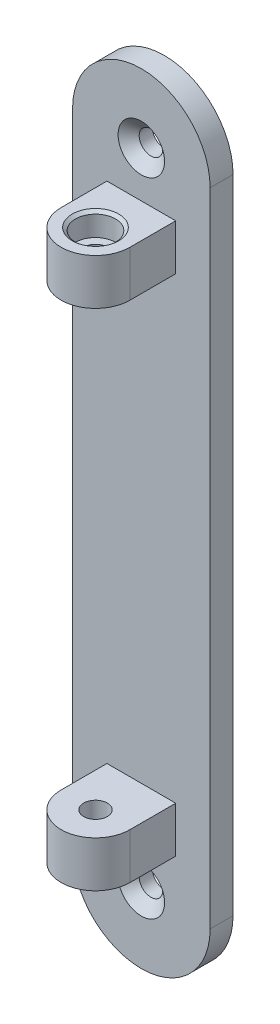
ISO-10303-21;
HEADER;
FILE_DESCRIPTION(('STEP AP214'),'2;1');
FILE_NAME('part.step','',(''),(''),'','','');
FILE_SCHEMA(('AUTOMOTIVE_DESIGN { 1 0 10303 214 1 1 1 1 }'));
ENDSEC;
DATA;
#1=APPLICATION_CONTEXT('core data for automotive mechanical design processes');
#2=APPLICATION_PROTOCOL_DEFINITION('international standard','automotive_design',2000,#1);
#3=PRODUCT_CONTEXT('',#1,'mechanical');
#4=PRODUCT('Part','Part','',(#3));
#5=PRODUCT_RELATED_PRODUCT_CATEGORY('part','',(#4));
#6=PRODUCT_DEFINITION_FORMATION('','',#4);
#7=PRODUCT_DEFINITION_CONTEXT('part definition',#1,'design');
#8=PRODUCT_DEFINITION('design','',#6,#7);
#9=PRODUCT_DEFINITION_SHAPE('','',#8);
#10=(LENGTH_UNIT() NAMED_UNIT(*) SI_UNIT(.MILLI.,.METRE.));
#11=(NAMED_UNIT(*) PLANE_ANGLE_UNIT() SI_UNIT($,.RADIAN.));
#12=(NAMED_UNIT(*) SI_UNIT($,.STERADIAN.) SOLID_ANGLE_UNIT());
#13=UNCERTAINTY_MEASURE_WITH_UNIT(LENGTH_MEASURE(1.E-05),#10,'distance_accuracy_value','');
#14=(GEOMETRIC_REPRESENTATION_CONTEXT(3) GLOBAL_UNCERTAINTY_ASSIGNED_CONTEXT((#13)) GLOBAL_UNIT_ASSIGNED_CONTEXT((#10,
#11,#12)) REPRESENTATION_CONTEXT('',''));
#15=CARTESIAN_POINT('',(0.,0.,0.));
#16=DIRECTION('',(0.,0.,1.));
#17=DIRECTION('',(1.,0.,0.));
#18=AXIS2_PLACEMENT_3D('',#15,#16,#17);
#19=CARTESIAN_POINT('',(19.05,88.9,0.));
#20=DIRECTION('',(0.,0.,-1.));
#21=DIRECTION('',(-1.,0.,0.));
#22=AXIS2_PLACEMENT_3D('',#19,#20,#21);
#23=PLANE('',#22);
#24=DIRECTION('',(0.,-1.,0.));
#25=VECTOR('',#24,1.);
#26=CARTESIAN_POINT('',(0.,0.,0.));
#27=LINE('',#26,#25);
#28=CARTESIAN_POINT('',(0.,88.9,0.));
#29=VERTEX_POINT('',#28);
#30=CARTESIAN_POINT('',(0.,-88.9,0.));
#31=VERTEX_POINT('',#30);
#32=EDGE_CURVE('E292',#29,#31,#27,.T.);
#33=ORIENTED_EDGE('',*,*,#32,.T.);
#34=CARTESIAN_POINT('',(19.05,-88.9,0.));
#35=DIRECTION('',(0.,0.,-1.));
#36=DIRECTION('',(-1.,0.,0.));
#37=AXIS2_PLACEMENT_3D('',#34,#35,#36);
#38=CIRCLE('',#37,19.05);
#39=CARTESIAN_POINT('',(38.1,-88.9,0.));
#40=VERTEX_POINT('',#39);
#41=EDGE_CURVE('E195',#40,#31,#38,.T.);
#42=ORIENTED_EDGE('',*,*,#41,.F.);
#43=DIRECTION('',(0.,1.,0.));
#44=VECTOR('',#43,1.);
#45=CARTESIAN_POINT('',(38.1,88.9,0.));
#46=LINE('',#45,#44);
#47=CARTESIAN_POINT('',(38.1,88.9,0.));
#48=VERTEX_POINT('',#47);
#49=EDGE_CURVE('E286',#40,#48,#46,.T.);
#50=ORIENTED_EDGE('',*,*,#49,.T.);
#51=CARTESIAN_POINT('',(19.05,88.9,0.));
#52=DIRECTION('',(0.,0.,1.));
#53=DIRECTION('',(-1.,0.,0.));
#54=AXIS2_PLACEMENT_3D('',#51,#52,#53);
#55=CIRCLE('',#54,19.05);
#56=EDGE_CURVE('E302',#48,#29,#55,.T.);
#57=ORIENTED_EDGE('',*,*,#56,.T.);
#58=EDGE_LOOP('',(#33,#42,#50,#57));
#59=FACE_BOUND('',#58,.T.);
#60=CARTESIAN_POINT('',(19.05,88.9,0.));
#61=DIRECTION('',(0.,0.,1.));
#62=DIRECTION('',(1.,0.,0.));
#63=AXIS2_PLACEMENT_3D('',#60,#61,#62);
#64=CIRCLE('',#63,6.4389);
#65=CARTESIAN_POINT('',(25.4889,88.9,0.));
#66=VERTEX_POINT('',#65);
#67=EDGE_CURVE('E274',#66,#66,#64,.T.);
#68=ORIENTED_EDGE('',*,*,#67,.F.);
#69=EDGE_LOOP('',(#68));
#70=FACE_BOUND('',#69,.T.);
#71=DIRECTION('',(0.,-1.,0.));
#72=VECTOR('',#71,1.);
#73=CARTESIAN_POINT('',(9.52500000000001,76.2,0.));
#74=LINE('',#73,#72);
#75=CARTESIAN_POINT('',(9.52500000000001,76.2,0.));
#76=VERTEX_POINT('',#75);
#77=CARTESIAN_POINT('',(9.525,63.5,0.));
#78=VERTEX_POINT('',#77);
#79=EDGE_CURVE('E236',#76,#78,#74,.T.);
#80=ORIENTED_EDGE('',*,*,#79,.F.);
#81=DIRECTION('',(-1.,0.,0.));
#82=VECTOR('',#81,1.);
#83=CARTESIAN_POINT('',(9.52500000000001,76.2,0.));
#84=LINE('',#83,#82);
#85=CARTESIAN_POINT('',(28.575,76.2,0.));
#86=VERTEX_POINT('',#85);
#87=EDGE_CURVE('E245',#86,#76,#84,.T.);
#88=ORIENTED_EDGE('',*,*,#87,.F.);
#89=DIRECTION('',(0.,1.,0.));
#90=VECTOR('',#89,1.);
#91=CARTESIAN_POINT('',(28.575,76.2,0.));
#92=LINE('',#91,#90);
#93=CARTESIAN_POINT('',(28.575,63.5,0.));
#94=VERTEX_POINT('',#93);
#95=EDGE_CURVE('E60',#94,#86,#92,.T.);
#96=ORIENTED_EDGE('',*,*,#95,.F.);
#97=DIRECTION('',(1.,0.,0.));
#98=VECTOR('',#97,1.);
#99=CARTESIAN_POINT('',(9.525,63.5,0.));
#100=LINE('',#99,#98);
#101=EDGE_CURVE('E55',#78,#94,#100,.T.);
#102=ORIENTED_EDGE('',*,*,#101,.F.);
#103=EDGE_LOOP('',(#80,#88,#96,#102));
#104=FACE_BOUND('',#103,.T.);
#105=CARTESIAN_POINT('',(19.05,-88.9,0.));
#106=DIRECTION('',(0.,0.,-1.));
#107=DIRECTION('',(1.,0.,0.));
#108=AXIS2_PLACEMENT_3D('',#105,#106,#107);
#109=CIRCLE('',#108,6.4389);
#110=CARTESIAN_POINT('',(25.4889,-88.9,0.));
#111=VERTEX_POINT('',#110);
#112=EDGE_CURVE('E183',#111,#111,#109,.T.);
#113=ORIENTED_EDGE('',*,*,#112,.T.);
#114=EDGE_LOOP('',(#113));
#115=FACE_BOUND('',#114,.T.);
#116=DIRECTION('',(0.,1.,0.));
#117=VECTOR('',#116,1.);
#118=CARTESIAN_POINT('',(9.525,-76.2,0.));
#119=LINE('',#118,#117);
#120=CARTESIAN_POINT('',(9.525,-76.2,0.));
#121=VERTEX_POINT('',#120);
#122=CARTESIAN_POINT('',(9.525,-63.5,0.));
#123=VERTEX_POINT('',#122);
#124=EDGE_CURVE('E154',#121,#123,#119,.T.);
#125=ORIENTED_EDGE('',*,*,#124,.T.);
#126=DIRECTION('',(1.,0.,0.));
#127=VECTOR('',#126,1.);
#128=CARTESIAN_POINT('',(9.525,-63.5,0.));
#129=LINE('',#128,#127);
#130=CARTESIAN_POINT('',(28.575,-63.5,0.));
#131=VERTEX_POINT('',#130);
#132=EDGE_CURVE('E159',#123,#131,#129,.T.);
#133=ORIENTED_EDGE('',*,*,#132,.T.);
#134=DIRECTION('',(0.,-1.,0.));
#135=VECTOR('',#134,1.);
#136=CARTESIAN_POINT('',(28.575,-76.2,0.));
#137=LINE('',#136,#135);
#138=CARTESIAN_POINT('',(28.575,-76.2,0.));
#139=VERTEX_POINT('',#138);
#140=EDGE_CURVE('E143',#131,#139,#137,.T.);
#141=ORIENTED_EDGE('',*,*,#140,.T.);
#142=DIRECTION('',(-1.,0.,0.));
#143=VECTOR('',#142,1.);
#144=CARTESIAN_POINT('',(9.525,-76.2,0.));
#145=LINE('',#144,#143);
#146=EDGE_CURVE('E168',#139,#121,#145,.T.);
#147=ORIENTED_EDGE('',*,*,#146,.T.);
#148=EDGE_LOOP('',(#125,#133,#141,#147));
#149=FACE_BOUND('',#148,.T.);
#150=ADVANCED_FACE('F39',(#59,#70,#104,#115,#149),#23,.F.);
#151=CARTESIAN_POINT('',(0.,0.,-6.35));
#152=DIRECTION('',(-1.,0.,0.));
#153=DIRECTION('',(0.,0.,1.));
#154=AXIS2_PLACEMENT_3D('',#151,#152,#153);
#155=PLANE('',#154);
#156=ORIENTED_EDGE('',*,*,#32,.F.);
#157=DIRECTION('',(0.,0.,1.));
#158=VECTOR('',#157,1.);
#159=CARTESIAN_POINT('',(0.,88.9,-6.35));
#160=LINE('',#159,#158);
#161=CARTESIAN_POINT('',(0.,88.9,-6.35));
#162=VERTEX_POINT('',#161);
#163=EDGE_CURVE('E11',#162,#29,#160,.T.);
#164=ORIENTED_EDGE('',*,*,#163,.F.);
#165=DIRECTION('',(0.,-1.,0.));
#166=VECTOR('',#165,1.);
#167=CARTESIAN_POINT('',(0.,0.,-6.35));
#168=LINE('',#167,#166);
#169=CARTESIAN_POINT('',(0.,-88.9,-6.35));
#170=VERTEX_POINT('',#169);
#171=EDGE_CURVE('E296',#162,#170,#168,.T.);
#172=ORIENTED_EDGE('',*,*,#171,.T.);
#173=DIRECTION('',(0.,0.,1.));
#174=VECTOR('',#173,1.);
#175=CARTESIAN_POINT('',(0.,-88.9,-6.35));
#176=LINE('',#175,#174);
#177=EDGE_CURVE('E204',#170,#31,#176,.T.);
#178=ORIENTED_EDGE('',*,*,#177,.T.);
#179=EDGE_LOOP('',(#156,#164,#172,#178));
#180=FACE_BOUND('',#179,.T.);
#181=ADVANCED_FACE('F314',(#180),#155,.T.);
#182=CARTESIAN_POINT('',(19.05,88.9,-6.35));
#183=DIRECTION('',(0.,0.,1.));
#184=DIRECTION('',(1.,0.,0.));
#185=AXIS2_PLACEMENT_3D('',#182,#183,#184);
#186=CYLINDRICAL_SURFACE('',#185,19.05);
#187=ORIENTED_EDGE('',*,*,#56,.F.);
#188=DIRECTION('',(0.,0.,1.));
#189=VECTOR('',#188,1.);
#190=CARTESIAN_POINT('',(38.1,88.9,-6.35));
#191=LINE('',#190,#189);
#192=CARTESIAN_POINT('',(38.1,88.9,-6.35));
#193=VERTEX_POINT('',#192);
#194=EDGE_CURVE('E43',#193,#48,#191,.T.);
#195=ORIENTED_EDGE('',*,*,#194,.F.);
#196=CARTESIAN_POINT('',(19.05,88.9,-6.35));
#197=DIRECTION('',(0.,0.,1.));
#198=DIRECTION('',(-1.,0.,0.));
#199=AXIS2_PLACEMENT_3D('',#196,#197,#198);
#200=CIRCLE('',#199,19.05);
#201=EDGE_CURVE('E291',#193,#162,#200,.T.);
#202=ORIENTED_EDGE('',*,*,#201,.T.);
#203=ORIENTED_EDGE('',*,*,#163,.T.);
#204=EDGE_LOOP('',(#187,#195,#202,#203));
#205=FACE_BOUND('',#204,.T.);
#206=ADVANCED_FACE('F324',(#205),#186,.T.);
#207=CARTESIAN_POINT('',(38.1,88.9,-6.35));
#208=DIRECTION('',(1.,0.,0.));
#209=DIRECTION('',(0.,1.,0.));
#210=AXIS2_PLACEMENT_3D('',#207,#208,#209);
#211=PLANE('',#210);
#212=ORIENTED_EDGE('',*,*,#49,.F.);
#213=DIRECTION('',(0.,0.,1.));
#214=VECTOR('',#213,1.);
#215=CARTESIAN_POINT('',(38.1,-88.9,-6.35));
#216=LINE('',#215,#214);
#217=CARTESIAN_POINT('',(38.1,-88.9,-6.35));
#218=VERTEX_POINT('',#217);
#219=EDGE_CURVE('E200',#218,#40,#216,.T.);
#220=ORIENTED_EDGE('',*,*,#219,.F.);
#221=DIRECTION('',(0.,1.,0.));
#222=VECTOR('',#221,1.);
#223=CARTESIAN_POINT('',(38.1,88.9,-6.35));
#224=LINE('',#223,#222);
#225=EDGE_CURVE('E287',#218,#193,#224,.T.);
#226=ORIENTED_EDGE('',*,*,#225,.T.);
#227=ORIENTED_EDGE('',*,*,#194,.T.);
#228=EDGE_LOOP('',(#212,#220,#226,#227));
#229=FACE_BOUND('',#228,.T.);
#230=ADVANCED_FACE('F41',(#229),#211,.T.);
#231=CARTESIAN_POINT('',(19.05,88.9,-6.35));
#232=DIRECTION('',(0.,0.,-1.));
#233=DIRECTION('',(-1.,0.,0.));
#234=AXIS2_PLACEMENT_3D('',#231,#232,#233);
#235=PLANE('',#234);
#236=CARTESIAN_POINT('',(19.05,88.9,-6.35));
#237=DIRECTION('',(0.,0.,1.));
#238=DIRECTION('',(1.,0.,0.));
#239=AXIS2_PLACEMENT_3D('',#236,#237,#238);
#240=CIRCLE('',#239,3.2639);
#241=CARTESIAN_POINT('',(22.3139,88.9,-6.35));
#242=VERTEX_POINT('',#241);
#243=EDGE_CURVE('E282',#242,#242,#240,.T.);
#244=ORIENTED_EDGE('',*,*,#243,.T.);
#245=EDGE_LOOP('',(#244));
#246=FACE_BOUND('',#245,.T.);
#247=ORIENTED_EDGE('',*,*,#225,.F.);
#248=CARTESIAN_POINT('',(19.05,-88.9,-6.35));
#249=DIRECTION('',(0.,0.,-1.));
#250=DIRECTION('',(-1.,0.,0.));
#251=AXIS2_PLACEMENT_3D('',#248,#249,#250);
#252=CIRCLE('',#251,19.05);
#253=EDGE_CURVE('E196',#218,#170,#252,.T.);
#254=ORIENTED_EDGE('',*,*,#253,.T.);
#255=ORIENTED_EDGE('',*,*,#171,.F.);
#256=ORIENTED_EDGE('',*,*,#201,.F.);
#257=EDGE_LOOP('',(#247,#254,#255,#256));
#258=FACE_BOUND('',#257,.T.);
#259=CARTESIAN_POINT('',(19.05,-88.9,-6.35));
#260=DIRECTION('',(0.,0.,-1.));
#261=DIRECTION('',(1.,0.,0.));
#262=AXIS2_PLACEMENT_3D('',#259,#260,#261);
#263=CIRCLE('',#262,3.2639);
#264=CARTESIAN_POINT('',(22.3139,-88.9,-6.35));
#265=VERTEX_POINT('',#264);
#266=EDGE_CURVE('E191',#265,#265,#263,.T.);
#267=ORIENTED_EDGE('',*,*,#266,.F.);
#268=EDGE_LOOP('',(#267));
#269=FACE_BOUND('',#268,.T.);
#270=ADVANCED_FACE('F326',(#246,#258,#269),#235,.T.);
#271=CARTESIAN_POINT('',(19.05,88.9,0.));
#272=DIRECTION('',(0.,0.,1.));
#273=DIRECTION('',(1.,0.,0.));
#274=AXIS2_PLACEMENT_3D('',#271,#272,#273);
#275=CYLINDRICAL_SURFACE('',#274,3.2639);
#276=ORIENTED_EDGE('',*,*,#243,.F.);
#277=EDGE_LOOP('',(#276));
#278=FACE_BOUND('',#277,.T.);
#279=CARTESIAN_POINT('',(19.05,88.9,-2.66414132898787));
#280=DIRECTION('',(0.,0.,1.));
#281=DIRECTION('',(1.,0.,0.));
#282=AXIS2_PLACEMENT_3D('',#279,#280,#281);
#283=CIRCLE('',#282,3.2639);
#284=CARTESIAN_POINT('',(22.3139,88.9,-2.66414132898787));
#285=VERTEX_POINT('',#284);
#286=EDGE_CURVE('E278',#285,#285,#283,.T.);
#287=ORIENTED_EDGE('',*,*,#286,.T.);
#288=EDGE_LOOP('',(#287));
#289=FACE_BOUND('',#288,.T.);
#290=ADVANCED_FACE('F329',(#278,#289),#275,.F.);
#291=CARTESIAN_POINT('',(19.05,88.9,0.));
#292=DIRECTION('',(0.,0.,1.));
#293=DIRECTION('',(1.,0.,0.));
#294=AXIS2_PLACEMENT_3D('',#291,#292,#293);
#295=CONICAL_SURFACE('',#294,6.4389,0.872664625997164);
#296=ORIENTED_EDGE('',*,*,#286,.F.);
#297=EDGE_LOOP('',(#296));
#298=FACE_BOUND('',#297,.T.);
#299=ORIENTED_EDGE('',*,*,#67,.T.);
#300=EDGE_LOOP('',(#299));
#301=FACE_BOUND('',#300,.T.);
#302=ADVANCED_FACE('F411',(#298,#301),#295,.F.);
#303=CARTESIAN_POINT('',(9.52500000000001,76.2,12.7));
#304=DIRECTION('',(1.,0.,0.));
#305=DIRECTION('',(0.,1.,0.));
#306=AXIS2_PLACEMENT_3D('',#303,#304,#305);
#307=PLANE('',#306);
#308=ORIENTED_EDGE('',*,*,#79,.T.);
#309=DIRECTION('',(0.,0.,-1.));
#310=VECTOR('',#309,1.);
#311=CARTESIAN_POINT('',(9.525,63.5,12.7));
#312=LINE('',#311,#310);
#313=CARTESIAN_POINT('',(9.525,63.5,12.7));
#314=VERTEX_POINT('',#313);
#315=EDGE_CURVE('E271',#314,#78,#312,.T.);
#316=ORIENTED_EDGE('',*,*,#315,.F.);
#317=DIRECTION('',(0.,-1.,0.));
#318=VECTOR('',#317,1.);
#319=CARTESIAN_POINT('',(9.52500000000001,76.2,12.7));
#320=LINE('',#319,#318);
#321=CARTESIAN_POINT('',(9.52500000000001,76.2,12.7));
#322=VERTEX_POINT('',#321);
#323=EDGE_CURVE('E240',#322,#314,#320,.T.);
#324=ORIENTED_EDGE('',*,*,#323,.F.);
#325=DIRECTION('',(0.,0.,-1.));
#326=VECTOR('',#325,1.);
#327=CARTESIAN_POINT('',(9.52500000000001,76.2,12.7));
#328=LINE('',#327,#326);
#329=EDGE_CURVE('E249',#322,#76,#328,.T.);
#330=ORIENTED_EDGE('',*,*,#329,.T.);
#331=EDGE_LOOP('',(#308,#316,#324,#330));
#332=FACE_BOUND('',#331,.T.);
#333=ADVANCED_FACE('F407',(#332),#307,.F.);
#334=CARTESIAN_POINT('',(9.525,63.5,12.7));
#335=DIRECTION('',(0.,1.,0.));
#336=DIRECTION('',(0.,0.,1.));
#337=AXIS2_PLACEMENT_3D('',#334,#335,#336);
#338=PLANE('',#337);
#339=CARTESIAN_POINT('',(19.05,63.5,12.7));
#340=DIRECTION('',(0.,1.,0.));
#341=DIRECTION('',(0.,0.,1.));
#342=AXIS2_PLACEMENT_3D('',#339,#340,#341);
#343=CIRCLE('',#342,3.2639);
#344=CARTESIAN_POINT('',(19.05,63.5,15.9639));
#345=VERTEX_POINT('',#344);
#346=EDGE_CURVE('E212',#345,#345,#343,.F.);
#347=ORIENTED_EDGE('',*,*,#346,.F.);
#348=EDGE_LOOP('',(#347));
#349=FACE_BOUND('',#348,.T.);
#350=ORIENTED_EDGE('',*,*,#101,.T.);
#351=DIRECTION('',(0.,0.,-1.));
#352=VECTOR('',#351,1.);
#353=CARTESIAN_POINT('',(28.575,63.5,12.7));
#354=LINE('',#353,#352);
#355=CARTESIAN_POINT('',(28.575,63.5,12.7));
#356=VERTEX_POINT('',#355);
#357=EDGE_CURVE('E267',#356,#94,#354,.T.);
#358=ORIENTED_EDGE('',*,*,#357,.F.);
#359=CARTESIAN_POINT('',(19.05,63.5,12.7));
#360=DIRECTION('',(0.,1.,0.));
#361=DIRECTION('',(0.,0.,1.));
#362=AXIS2_PLACEMENT_3D('',#359,#360,#361);
#363=CIRCLE('',#362,9.525);
#364=EDGE_CURVE('E232',#356,#314,#363,.F.);
#365=ORIENTED_EDGE('',*,*,#364,.T.);
#366=ORIENTED_EDGE('',*,*,#315,.T.);
#367=EDGE_LOOP('',(#350,#358,#365,#366));
#368=FACE_BOUND('',#367,.T.);
#369=ADVANCED_FACE('F403',(#349,#368),#338,.F.);
#370=CARTESIAN_POINT('',(28.575,76.2,12.7));
#371=DIRECTION('',(-1.,0.,0.));
#372=DIRECTION('',(0.,0.,1.));
#373=AXIS2_PLACEMENT_3D('',#370,#371,#372);
#374=PLANE('',#373);
#375=ORIENTED_EDGE('',*,*,#95,.T.);
#376=DIRECTION('',(0.,0.,-1.));
#377=VECTOR('',#376,1.);
#378=CARTESIAN_POINT('',(28.575,76.2,12.7));
#379=LINE('',#378,#377);
#380=CARTESIAN_POINT('',(28.575,76.2,12.7));
#381=VERTEX_POINT('',#380);
#382=EDGE_CURVE('E263',#381,#86,#379,.T.);
#383=ORIENTED_EDGE('',*,*,#382,.F.);
#384=DIRECTION('',(0.,1.,0.));
#385=VECTOR('',#384,1.);
#386=CARTESIAN_POINT('',(28.575,76.2,12.7));
#387=LINE('',#386,#385);
#388=EDGE_CURVE('E244',#356,#381,#387,.T.);
#389=ORIENTED_EDGE('',*,*,#388,.F.);
#390=ORIENTED_EDGE('',*,*,#357,.T.);
#391=EDGE_LOOP('',(#375,#383,#389,#390));
#392=FACE_BOUND('',#391,.T.);
#393=ADVANCED_FACE('F399',(#392),#374,.F.);
#394=CARTESIAN_POINT('',(9.52500000000001,76.2,12.7));
#395=DIRECTION('',(0.,-1.,0.));
#396=DIRECTION('',(0.,0.,-1.));
#397=AXIS2_PLACEMENT_3D('',#394,#395,#396);
#398=PLANE('',#397);
#399=CARTESIAN_POINT('',(19.05,76.2,12.7));
#400=DIRECTION('',(0.,1.,0.));
#401=DIRECTION('',(0.,0.,1.));
#402=AXIS2_PLACEMENT_3D('',#399,#400,#401);
#403=CIRCLE('',#402,6.4389);
#404=CARTESIAN_POINT('',(19.05,76.2,19.1389));
#405=VERTEX_POINT('',#404);
#406=EDGE_CURVE('E208',#405,#405,#403,.T.);
#407=ORIENTED_EDGE('',*,*,#406,.F.);
#408=EDGE_LOOP('',(#407));
#409=FACE_BOUND('',#408,.T.);
#410=ORIENTED_EDGE('',*,*,#87,.T.);
#411=ORIENTED_EDGE('',*,*,#329,.F.);
#412=CARTESIAN_POINT('',(19.05,76.2,12.7));
#413=DIRECTION('',(0.,1.,0.));
#414=DIRECTION('',(0.,0.,-1.));
#415=AXIS2_PLACEMENT_3D('',#412,#413,#414);
#416=CIRCLE('',#415,9.525);
#417=EDGE_CURVE('E216',#322,#381,#416,.T.);
#418=ORIENTED_EDGE('',*,*,#417,.T.);
#419=ORIENTED_EDGE('',*,*,#382,.T.);
#420=EDGE_LOOP('',(#410,#411,#418,#419));
#421=FACE_BOUND('',#420,.T.);
#422=ADVANCED_FACE('F395',(#409,#421),#398,.F.);
#423=CARTESIAN_POINT('',(19.05,42.2014525143145,12.7));
#424=DIRECTION('',(0.,1.,0.));
#425=DIRECTION('',(0.,0.,1.));
#426=AXIS2_PLACEMENT_3D('',#423,#424,#425);
#427=CYLINDRICAL_SURFACE('',#426,9.525);
#428=ORIENTED_EDGE('',*,*,#364,.F.);
#429=ORIENTED_EDGE('',*,*,#388,.T.);
#430=ORIENTED_EDGE('',*,*,#417,.F.);
#431=ORIENTED_EDGE('',*,*,#323,.T.);
#432=EDGE_LOOP('',(#428,#429,#430,#431));
#433=FACE_BOUND('',#432,.T.);
#434=ADVANCED_FACE('F391',(#433),#427,.T.);
#435=CARTESIAN_POINT('',(19.05,76.2,12.7));
#436=DIRECTION('',(0.,1.,0.));
#437=DIRECTION('',(0.,0.,1.));
#438=AXIS2_PLACEMENT_3D('',#435,#436,#437);
#439=CYLINDRICAL_SURFACE('',#438,3.2639);
#440=ORIENTED_EDGE('',*,*,#346,.T.);
#441=EDGE_LOOP('',(#440));
#442=FACE_BOUND('',#441,.T.);
#443=CARTESIAN_POINT('',(19.05,69.85,12.7));
#444=DIRECTION('',(0.,1.,0.));
#445=DIRECTION('',(0.,0.,1.));
#446=AXIS2_PLACEMENT_3D('',#443,#444,#445);
#447=CIRCLE('',#446,3.2639);
#448=CARTESIAN_POINT('',(19.05,69.85,15.9639));
#449=VERTEX_POINT('',#448);
#450=EDGE_CURVE('E217',#449,#449,#447,.T.);
#451=ORIENTED_EDGE('',*,*,#450,.T.);
#452=EDGE_LOOP('',(#451));
#453=FACE_BOUND('',#452,.T.);
#454=ADVANCED_FACE('F387',(#442,#453),#439,.F.);
#455=CARTESIAN_POINT('',(22.3139,69.85,12.7));
#456=DIRECTION('',(0.,-1.,0.));
#457=DIRECTION('',(0.,0.,-1.));
#458=AXIS2_PLACEMENT_3D('',#455,#456,#457);
#459=PLANE('',#458);
#460=ORIENTED_EDGE('',*,*,#450,.F.);
#461=EDGE_LOOP('',(#460));
#462=FACE_BOUND('',#461,.T.);
#463=CARTESIAN_POINT('',(19.05,69.85,12.7));
#464=DIRECTION('',(0.,1.,0.));
#465=DIRECTION('',(0.,0.,1.));
#466=AXIS2_PLACEMENT_3D('',#463,#464,#465);
#467=CIRCLE('',#466,5.55625);
#468=CARTESIAN_POINT('',(19.05,69.85,18.25625));
#469=VERTEX_POINT('',#468);
#470=EDGE_CURVE('E225',#469,#469,#467,.T.);
#471=ORIENTED_EDGE('',*,*,#470,.T.);
#472=EDGE_LOOP('',(#471));
#473=FACE_BOUND('',#472,.T.);
#474=ADVANCED_FACE('F383',(#462,#473),#459,.F.);
#475=CARTESIAN_POINT('',(19.05,76.2,12.7));
#476=DIRECTION('',(0.,1.,0.));
#477=DIRECTION('',(0.,0.,1.));
#478=AXIS2_PLACEMENT_3D('',#475,#476,#477);
#479=CYLINDRICAL_SURFACE('',#478,5.55625);
#480=ORIENTED_EDGE('',*,*,#470,.F.);
#481=EDGE_LOOP('',(#480));
#482=FACE_BOUND('',#481,.T.);
#483=CARTESIAN_POINT('',(19.05,75.4593687105414,12.7));
#484=DIRECTION('',(0.,1.,0.));
#485=DIRECTION('',(0.,0.,1.));
#486=AXIS2_PLACEMENT_3D('',#483,#484,#485);
#487=CIRCLE('',#486,5.55625);
#488=CARTESIAN_POINT('',(19.05,75.4593687105414,18.25625));
#489=VERTEX_POINT('',#488);
#490=EDGE_CURVE('E221',#489,#489,#487,.T.);
#491=ORIENTED_EDGE('',*,*,#490,.T.);
#492=EDGE_LOOP('',(#491));
#493=FACE_BOUND('',#492,.T.);
#494=ADVANCED_FACE('F379',(#482,#493),#479,.F.);
#495=CARTESIAN_POINT('',(19.05,76.2,12.7));
#496=DIRECTION('',(0.,1.,0.));
#497=DIRECTION('',(0.,0.,1.));
#498=AXIS2_PLACEMENT_3D('',#495,#496,#497);
#499=CONICAL_SURFACE('',#498,6.4389,0.872664625997164);
#500=ORIENTED_EDGE('',*,*,#490,.F.);
#501=EDGE_LOOP('',(#500));
#502=FACE_BOUND('',#501,.T.);
#503=ORIENTED_EDGE('',*,*,#406,.T.);
#504=EDGE_LOOP('',(#503));
#505=FACE_BOUND('',#504,.T.);
#506=ADVANCED_FACE('F376',(#502,#505),#499,.F.);
#507=CARTESIAN_POINT('',(19.05,-88.9,-6.35));
#508=DIRECTION('',(0.,0.,1.));
#509=DIRECTION('',(1.,0.,0.));
#510=AXIS2_PLACEMENT_3D('',#507,#508,#509);
#511=CYLINDRICAL_SURFACE('',#510,19.05);
#512=ORIENTED_EDGE('',*,*,#41,.T.);
#513=ORIENTED_EDGE('',*,*,#177,.F.);
#514=ORIENTED_EDGE('',*,*,#253,.F.);
#515=ORIENTED_EDGE('',*,*,#219,.T.);
#516=EDGE_LOOP('',(#512,#513,#514,#515));
#517=FACE_BOUND('',#516,.T.);
#518=ADVANCED_FACE('F318',(#517),#511,.T.);
#519=CARTESIAN_POINT('',(19.05,-88.9,0.));
#520=DIRECTION('',(0.,0.,1.));
#521=DIRECTION('',(1.,0.,0.));
#522=AXIS2_PLACEMENT_3D('',#519,#520,#521);
#523=CYLINDRICAL_SURFACE('',#522,3.2639);
#524=ORIENTED_EDGE('',*,*,#266,.T.);
#525=EDGE_LOOP('',(#524));
#526=FACE_BOUND('',#525,.T.);
#527=CARTESIAN_POINT('',(19.05,-88.9,-2.66414132898787));
#528=DIRECTION('',(0.,0.,-1.));
#529=DIRECTION('',(1.,0.,0.));
#530=AXIS2_PLACEMENT_3D('',#527,#528,#529);
#531=CIRCLE('',#530,3.2639);
#532=CARTESIAN_POINT('',(22.3139,-88.9,-2.66414132898787));
#533=VERTEX_POINT('',#532);
#534=EDGE_CURVE('E187',#533,#533,#531,.T.);
#535=ORIENTED_EDGE('',*,*,#534,.F.);
#536=EDGE_LOOP('',(#535));
#537=FACE_BOUND('',#536,.T.);
#538=ADVANCED_FACE('F334',(#526,#537),#523,.F.);
#539=CARTESIAN_POINT('',(19.05,-88.9,0.));
#540=DIRECTION('',(0.,0.,1.));
#541=DIRECTION('',(1.,0.,0.));
#542=AXIS2_PLACEMENT_3D('',#539,#540,#541);
#543=CONICAL_SURFACE('',#542,6.4389,0.872664625997164);
#544=ORIENTED_EDGE('',*,*,#534,.T.);
#545=EDGE_LOOP('',(#544));
#546=FACE_BOUND('',#545,.T.);
#547=ORIENTED_EDGE('',*,*,#112,.F.);
#548=EDGE_LOOP('',(#547));
#549=FACE_BOUND('',#548,.T.);
#550=ADVANCED_FACE('F337',(#546,#549),#543,.F.);
#551=CARTESIAN_POINT('',(9.525,-76.2,12.7));
#552=DIRECTION('',(1.,0.,0.));
#553=DIRECTION('',(0.,-1.,0.));
#554=AXIS2_PLACEMENT_3D('',#551,#552,#553);
#555=PLANE('',#554);
#556=ORIENTED_EDGE('',*,*,#124,.F.);
#557=DIRECTION('',(0.,0.,-1.));
#558=VECTOR('',#557,1.);
#559=CARTESIAN_POINT('',(9.525,-76.2,12.7));
#560=LINE('',#559,#558);
#561=CARTESIAN_POINT('',(9.525,-76.2,12.7));
#562=VERTEX_POINT('',#561);
#563=EDGE_CURVE('E136',#562,#121,#560,.T.);
#564=ORIENTED_EDGE('',*,*,#563,.F.);
#565=DIRECTION('',(0.,1.,0.));
#566=VECTOR('',#565,1.);
#567=CARTESIAN_POINT('',(9.525,-76.2,12.7));
#568=LINE('',#567,#566);
#569=CARTESIAN_POINT('',(9.525,-63.5,12.7));
#570=VERTEX_POINT('',#569);
#571=EDGE_CURVE('E137',#562,#570,#568,.T.);
#572=ORIENTED_EDGE('',*,*,#571,.T.);
#573=DIRECTION('',(0.,0.,-1.));
#574=VECTOR('',#573,1.);
#575=CARTESIAN_POINT('',(9.525,-63.5,12.7));
#576=LINE('',#575,#574);
#577=EDGE_CURVE('E148',#570,#123,#576,.T.);
#578=ORIENTED_EDGE('',*,*,#577,.T.);
#579=EDGE_LOOP('',(#556,#564,#572,#578));
#580=FACE_BOUND('',#579,.T.);
#581=ADVANCED_FACE('F343',(#580),#555,.F.);
#582=CARTESIAN_POINT('',(9.525,-63.5,12.7));
#583=DIRECTION('',(0.,-1.,0.));
#584=DIRECTION('',(0.,0.,1.));
#585=AXIS2_PLACEMENT_3D('',#582,#583,#584);
#586=PLANE('',#585);
#587=CARTESIAN_POINT('',(19.05,-63.5,12.7));
#588=DIRECTION('',(0.,1.,0.));
#589=DIRECTION('',(0.,0.,1.));
#590=AXIS2_PLACEMENT_3D('',#587,#588,#589);
#591=CIRCLE('',#590,3.2639);
#592=CARTESIAN_POINT('',(19.05,-63.5,15.9639));
#593=VERTEX_POINT('',#592);
#594=EDGE_CURVE('E161',#593,#593,#591,.F.);
#595=ORIENTED_EDGE('',*,*,#594,.T.);
#596=EDGE_LOOP('',(#595));
#597=FACE_BOUND('',#596,.T.);
#598=ORIENTED_EDGE('',*,*,#132,.F.);
#599=ORIENTED_EDGE('',*,*,#577,.F.);
#600=CARTESIAN_POINT('',(19.05,-63.5,12.7));
#601=DIRECTION('',(0.,1.,0.));
#602=DIRECTION('',(0.,0.,1.));
#603=AXIS2_PLACEMENT_3D('',#600,#601,#602);
#604=CIRCLE('',#603,9.525);
#605=CARTESIAN_POINT('',(28.575,-63.5,12.7));
#606=VERTEX_POINT('',#605);
#607=EDGE_CURVE('E130',#606,#570,#604,.F.);
#608=ORIENTED_EDGE('',*,*,#607,.F.);
#609=DIRECTION('',(0.,0.,-1.));
#610=VECTOR('',#609,1.);
#611=CARTESIAN_POINT('',(28.575,-63.5,12.7));
#612=LINE('',#611,#610);
#613=EDGE_CURVE('E140',#606,#131,#612,.T.);
#614=ORIENTED_EDGE('',*,*,#613,.T.);
#615=EDGE_LOOP('',(#598,#599,#608,#614));
#616=FACE_BOUND('',#615,.T.);
#617=ADVANCED_FACE('F151',(#597,#616),#586,.F.);
#618=CARTESIAN_POINT('',(28.575,-76.2,12.7));
#619=DIRECTION('',(-1.,0.,0.));
#620=DIRECTION('',(0.,0.,1.));
#621=AXIS2_PLACEMENT_3D('',#618,#619,#620);
#622=PLANE('',#621);
#623=ORIENTED_EDGE('',*,*,#140,.F.);
#624=ORIENTED_EDGE('',*,*,#613,.F.);
#625=DIRECTION('',(0.,-1.,0.));
#626=VECTOR('',#625,1.);
#627=CARTESIAN_POINT('',(28.575,-76.2,12.7));
#628=LINE('',#627,#626);
#629=CARTESIAN_POINT('',(28.575,-76.2,12.7));
#630=VERTEX_POINT('',#629);
#631=EDGE_CURVE('E125',#606,#630,#628,.T.);
#632=ORIENTED_EDGE('',*,*,#631,.T.);
#633=DIRECTION('',(0.,0.,-1.));
#634=VECTOR('',#633,1.);
#635=CARTESIAN_POINT('',(28.575,-76.2,12.7));
#636=LINE('',#635,#634);
#637=EDGE_CURVE('E149',#630,#139,#636,.T.);
#638=ORIENTED_EDGE('',*,*,#637,.T.);
#639=EDGE_LOOP('',(#623,#624,#632,#638));
#640=FACE_BOUND('',#639,.T.);
#641=ADVANCED_FACE('F141',(#640),#622,.F.);
#642=CARTESIAN_POINT('',(9.525,-76.2,12.7));
#643=DIRECTION('',(0.,1.,0.));
#644=DIRECTION('',(0.,0.,-1.));
#645=AXIS2_PLACEMENT_3D('',#642,#643,#644);
#646=PLANE('',#645);
#647=CARTESIAN_POINT('',(19.05,-76.2,12.7));
#648=DIRECTION('',(0.,1.,0.));
#649=DIRECTION('',(0.,0.,1.));
#650=AXIS2_PLACEMENT_3D('',#647,#648,#649);
#651=CIRCLE('',#650,6.4389);
#652=CARTESIAN_POINT('',(19.05,-76.2,19.1389));
#653=VERTEX_POINT('',#652);
#654=EDGE_CURVE('E570',#653,#653,#651,.T.);
#655=ORIENTED_EDGE('',*,*,#654,.T.);
#656=EDGE_LOOP('',(#655));
#657=FACE_BOUND('',#656,.T.);
#658=ORIENTED_EDGE('',*,*,#146,.F.);
#659=ORIENTED_EDGE('',*,*,#637,.F.);
#660=CARTESIAN_POINT('',(19.05,-76.2,12.7));
#661=DIRECTION('',(0.,1.,0.));
#662=DIRECTION('',(0.,0.,-1.));
#663=AXIS2_PLACEMENT_3D('',#660,#661,#662);
#664=CIRCLE('',#663,9.525);
#665=EDGE_CURVE('E132',#562,#630,#664,.T.);
#666=ORIENTED_EDGE('',*,*,#665,.F.);
#667=ORIENTED_EDGE('',*,*,#563,.T.);
#668=EDGE_LOOP('',(#658,#659,#666,#667));
#669=FACE_BOUND('',#668,.T.);
#670=ADVANCED_FACE('F355',(#657,#669),#646,.F.);
#671=CARTESIAN_POINT('',(19.05,-42.2014525143145,12.7));
#672=DIRECTION('',(0.,-1.,0.));
#673=DIRECTION('',(0.,0.,1.));
#674=AXIS2_PLACEMENT_3D('',#671,#672,#673);
#675=CYLINDRICAL_SURFACE('',#674,9.525);
#676=ORIENTED_EDGE('',*,*,#607,.T.);
#677=ORIENTED_EDGE('',*,*,#571,.F.);
#678=ORIENTED_EDGE('',*,*,#665,.T.);
#679=ORIENTED_EDGE('',*,*,#631,.F.);
#680=EDGE_LOOP('',(#676,#677,#678,#679));
#681=FACE_BOUND('',#680,.T.);
#682=ADVANCED_FACE('F127',(#681),#675,.T.);
#683=CARTESIAN_POINT('',(19.05,-76.2,12.7));
#684=DIRECTION('',(0.,-1.,0.));
#685=DIRECTION('',(0.,0.,1.));
#686=AXIS2_PLACEMENT_3D('',#683,#684,#685);
#687=CYLINDRICAL_SURFACE('',#686,3.2639);
#688=ORIENTED_EDGE('',*,*,#594,.F.);
#689=EDGE_LOOP('',(#688));
#690=FACE_BOUND('',#689,.T.);
#691=CARTESIAN_POINT('',(19.05,-69.85,12.7));
#692=DIRECTION('',(0.,1.,0.));
#693=DIRECTION('',(0.,0.,1.));
#694=AXIS2_PLACEMENT_3D('',#691,#692,#693);
#695=CIRCLE('',#694,3.2639);
#696=CARTESIAN_POINT('',(19.05,-69.85,15.9639));
#697=VERTEX_POINT('',#696);
#698=EDGE_CURVE('E164',#697,#697,#695,.T.);
#699=ORIENTED_EDGE('',*,*,#698,.F.);
#700=EDGE_LOOP('',(#699));
#701=FACE_BOUND('',#700,.T.);
#702=ADVANCED_FACE('F363',(#690,#701),#687,.F.);
#703=CARTESIAN_POINT('',(22.3139,-69.85,12.7));
#704=DIRECTION('',(0.,1.,0.));
#705=DIRECTION('',(0.,0.,-1.));
#706=AXIS2_PLACEMENT_3D('',#703,#704,#705);
#707=PLANE('',#706);
#708=ORIENTED_EDGE('',*,*,#698,.T.);
#709=EDGE_LOOP('',(#708));
#710=FACE_BOUND('',#709,.T.);
#711=CARTESIAN_POINT('',(19.05,-69.85,12.7));
#712=DIRECTION('',(0.,1.,0.));
#713=DIRECTION('',(0.,0.,1.));
#714=AXIS2_PLACEMENT_3D('',#711,#712,#713);
#715=CIRCLE('',#714,5.55625);
#716=CARTESIAN_POINT('',(19.05,-69.85,18.25625));
#717=VERTEX_POINT('',#716);
#718=EDGE_CURVE('E574',#717,#717,#715,.T.);
#719=ORIENTED_EDGE('',*,*,#718,.F.);
#720=EDGE_LOOP('',(#719));
#721=FACE_BOUND('',#720,.T.);
#722=ADVANCED_FACE('F532',(#710,#721),#707,.F.);
#723=CARTESIAN_POINT('',(19.05,-76.2,12.7));
#724=DIRECTION('',(0.,-1.,0.));
#725=DIRECTION('',(0.,0.,1.));
#726=AXIS2_PLACEMENT_3D('',#723,#724,#725);
#727=CYLINDRICAL_SURFACE('',#726,5.55625);
#728=ORIENTED_EDGE('',*,*,#718,.T.);
#729=EDGE_LOOP('',(#728));
#730=FACE_BOUND('',#729,.T.);
#731=CARTESIAN_POINT('',(19.05,-75.4593687105414,12.7));
#732=DIRECTION('',(0.,1.,0.));
#733=DIRECTION('',(0.,0.,1.));
#734=AXIS2_PLACEMENT_3D('',#731,#732,#733);
#735=CIRCLE('',#734,5.55625);
#736=CARTESIAN_POINT('',(19.05,-75.4593687105414,18.25625));
#737=VERTEX_POINT('',#736);
#738=EDGE_CURVE('E568',#737,#737,#735,.T.);
#739=ORIENTED_EDGE('',*,*,#738,.F.);
#740=EDGE_LOOP('',(#739));
#741=FACE_BOUND('',#740,.T.);
#742=ADVANCED_FACE('F541',(#730,#741),#727,.F.);
#743=CARTESIAN_POINT('',(19.05,-76.2,12.7));
#744=DIRECTION('',(0.,-1.,0.));
#745=DIRECTION('',(0.,0.,1.));
#746=AXIS2_PLACEMENT_3D('',#743,#744,#745);
#747=CONICAL_SURFACE('',#746,6.4389,0.872664625997164);
#748=ORIENTED_EDGE('',*,*,#738,.T.);
#749=EDGE_LOOP('',(#748));
#750=FACE_BOUND('',#749,.T.);
#751=ORIENTED_EDGE('',*,*,#654,.F.);
#752=EDGE_LOOP('',(#751));
#753=FACE_BOUND('',#752,.T.);
#754=ADVANCED_FACE('F551',(#750,#753),#747,.F.);
#755=CLOSED_SHELL('',(#150,#181,#206,#230,#270,#290,#302,#333,#369,#393,#422,#434,#454,#474,
#494,#506,#518,#538,#550,#581,#617,#641,#670,#682,#702,#722,#742,#754));
#756=MANIFOLD_SOLID_BREP('B2',#755);
#757=ADVANCED_BREP_SHAPE_REPRESENTATION('',(#18,#756),#14);
#758=SHAPE_DEFINITION_REPRESENTATION(#9,#757);
ENDSEC;
END-ISO-10303-21;
